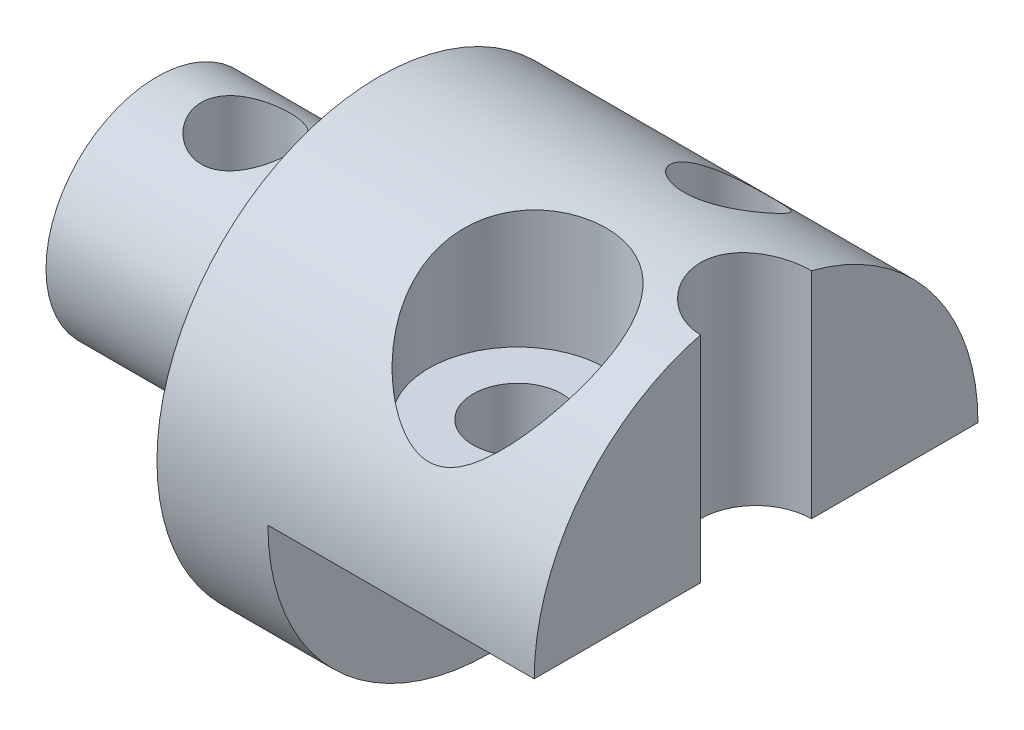
ISO-10303-21;
HEADER;
FILE_DESCRIPTION(('STEP AP214'),'2;1');
FILE_NAME('part.step','',(''),(''),'','','');
FILE_SCHEMA(('AUTOMOTIVE_DESIGN { 1 0 10303 214 1 1 1 1 }'));
ENDSEC;
DATA;
#1=APPLICATION_CONTEXT('core data for automotive mechanical design processes');
#2=APPLICATION_PROTOCOL_DEFINITION('international standard','automotive_design',2000,#1);
#3=PRODUCT_CONTEXT('',#1,'mechanical');
#4=PRODUCT('Part','Part','',(#3));
#5=PRODUCT_RELATED_PRODUCT_CATEGORY('part','',(#4));
#6=PRODUCT_DEFINITION_FORMATION('','',#4);
#7=PRODUCT_DEFINITION_CONTEXT('part definition',#1,'design');
#8=PRODUCT_DEFINITION('design','',#6,#7);
#9=PRODUCT_DEFINITION_SHAPE('','',#8);
#10=(LENGTH_UNIT() NAMED_UNIT(*) SI_UNIT(.MILLI.,.METRE.));
#11=(NAMED_UNIT(*) PLANE_ANGLE_UNIT() SI_UNIT($,.RADIAN.));
#12=(NAMED_UNIT(*) SI_UNIT($,.STERADIAN.) SOLID_ANGLE_UNIT());
#13=UNCERTAINTY_MEASURE_WITH_UNIT(LENGTH_MEASURE(1.E-05),#10,'distance_accuracy_value','');
#14=(GEOMETRIC_REPRESENTATION_CONTEXT(3) GLOBAL_UNCERTAINTY_ASSIGNED_CONTEXT((#13)) GLOBAL_UNIT_ASSIGNED_CONTEXT((#10,
#11,#12)) REPRESENTATION_CONTEXT('',''));
#15=CARTESIAN_POINT('',(0.,0.,0.));
#16=DIRECTION('',(0.,0.,1.));
#17=DIRECTION('',(1.,0.,0.));
#18=AXIS2_PLACEMENT_3D('',#15,#16,#17);
#19=CARTESIAN_POINT('',(-12.5,0.,0.874999999999988));
#20=DIRECTION('',(-1.,0.,0.));
#21=DIRECTION('',(0.,0.,1.));
#22=AXIS2_PLACEMENT_3D('',#19,#20,#21);
#23=CYLINDRICAL_SURFACE('',#22,10.);
#24=CARTESIAN_POINT('',(8.49999999999995,9.97183533758956,1.62499999999999));
#25=CARTESIAN_POINT('',(8.72342857085597,9.97183501271069,1.62499811854851));
#26=CARTESIAN_POINT('',(8.946846948339,9.97047722592947,1.64376344430953));
#27=CARTESIAN_POINT('',(9.38738048859625,9.96444970100898,1.71828136137339));
#28=CARTESIAN_POINT('',(9.60449597693852,9.95978013425366,1.77403203868208));
#29=CARTESIAN_POINT('',(10.0263494903959,9.9454236180423,1.92092645686251));
#30=CARTESIAN_POINT('',(10.2310819959248,9.93573444929036,2.01208584837815));
#31=CARTESIAN_POINT('',(10.6221208568015,9.90877159014059,2.22700638030204));
#32=CARTESIAN_POINT('',(10.8084283944862,9.89149838680048,2.35076542690888));
#33=CARTESIAN_POINT('',(11.1554759178273,9.84656559166447,2.62550693216701));
#34=CARTESIAN_POINT('',(11.3164400827609,9.81900530694927,2.77622214495401));
#35=CARTESIAN_POINT('',(11.6102597553043,9.75065968728539,3.100303276879));
#36=CARTESIAN_POINT('',(11.7431226982437,9.70987785788948,3.27366318474869));
#37=CARTESIAN_POINT('',(11.9748827021514,9.61402999766722,3.63255676451592));
#38=CARTESIAN_POINT('',(12.07445889747,9.55929578165851,3.81774138502876));
#39=CARTESIAN_POINT('',(12.2421037379824,9.43425514387872,4.19684346058784));
#40=CARTESIAN_POINT('',(12.3101726088619,9.36394883365528,4.39076085307064));
#41=CARTESIAN_POINT('',(12.4158618228328,9.20697776298318,4.78357036727107));
#42=CARTESIAN_POINT('',(12.4530358226371,9.12009477877165,4.98249402453808));
#43=CARTESIAN_POINT('',(12.4972301899204,8.93203024885893,5.37684869442238));
#44=CARTESIAN_POINT('',(12.5042373479112,8.83084245938066,5.57227813969841));
#45=CARTESIAN_POINT('',(12.4902634957933,8.60517520022657,5.97495589843248));
#46=CARTESIAN_POINT('',(12.4663270069729,8.47937032554607,6.18134982995202));
#47=CARTESIAN_POINT('',(12.3894929335148,8.21602505383958,6.58063333265788));
#48=CARTESIAN_POINT('',(12.3365895635665,8.07848231714327,6.77352019750923));
#49=CARTESIAN_POINT('',(12.1932519011426,7.76777080241629,7.17886539275976));
#50=CARTESIAN_POINT('',(12.0975970493884,7.59279788792603,7.38808064028162));
#51=CARTESIAN_POINT('',(11.8755071509979,7.23526200893511,7.78312050252622));
#52=CARTESIAN_POINT('',(11.7490014092136,7.05268242199759,7.96888988553797));
#53=CARTESIAN_POINT('',(11.5229705130496,6.75741298953425,8.24799938840879));
#54=CARTESIAN_POINT('',(11.4321755824009,6.64524775944447,8.34912325011631));
#55=CARTESIAN_POINT('',(11.2402477055323,6.42161044278618,8.54211899416098));
#56=CARTESIAN_POINT('',(11.1391097012663,6.3101387239032,8.63398630577538));
#57=CARTESIAN_POINT('',(10.9265678052276,6.09010660698456,8.80785603043938));
#58=CARTESIAN_POINT('',(10.8151944761701,5.98153871589737,8.88988622841203));
#59=CARTESIAN_POINT('',(10.5812252165511,5.76957639269819,9.04378745203308));
#60=CARTESIAN_POINT('',(10.458640816699,5.666176810547,9.115668726577));
#61=CARTESIAN_POINT('',(10.2171046772641,5.48079621343581,9.23990917601555));
#62=CARTESIAN_POINT('',(10.099657117781,5.39776073729095,9.29358773570201));
#63=CARTESIAN_POINT('',(9.85387154207294,5.24233315419241,9.39124033995246));
#64=CARTESIAN_POINT('',(9.72552583926481,5.16994865950102,9.43520745487968));
#65=CARTESIAN_POINT('',(9.45480811272252,5.04073075566054,9.51194430032071));
#66=CARTESIAN_POINT('',(9.31224116088062,4.98417078809039,9.54451931914301));
#67=CARTESIAN_POINT('',(9.09104043196444,4.91856504834529,9.5817992963765));
#68=CARTESIAN_POINT('',(9.01619061621851,4.89991476411214,9.59228897391451));
#69=CARTESIAN_POINT('',(8.86456284473983,4.86992200172336,9.60908030142984));
#70=CARTESIAN_POINT('',(8.78778561206175,4.85857682445405,9.61538349826823));
#71=CARTESIAN_POINT('',(8.64433927690126,4.84494695846125,9.62294484410437));
#72=CARTESIAN_POINT('',(8.5778013737546,4.84159537183624,9.62479735030693));
#73=CARTESIAN_POINT('',(8.44466064590822,4.84091998873766,9.62517111569836));
#74=CARTESIAN_POINT('',(8.37805780738028,4.84359808615998,9.62369132822916));
#75=CARTESIAN_POINT('',(8.24545825112978,4.85486312607168,9.61744500173219));
#76=CARTESIAN_POINT('',(8.17946209201385,4.86345505040742,9.61267569158204));
#77=CARTESIAN_POINT('',(8.04871261200747,4.88614898458137,9.60000512120433));
#78=CARTESIAN_POINT('',(7.98396010689085,4.90025448969461,9.59210187420523));
#79=CARTESIAN_POINT('',(7.77815065379163,4.95368239696007,9.56193437774407));
#80=CARTESIAN_POINT('',(7.64040752117642,5.00277166966406,9.53391456222897));
#81=CARTESIAN_POINT('',(7.37558707411236,5.11823505513678,9.46616435488908));
#82=CARTESIAN_POINT('',(7.24853478201866,5.18464830439866,9.42640742066351));
#83=CARTESIAN_POINT('',(7.0231959181665,5.3179682534963,9.34402729969812));
#84=CARTESIAN_POINT('',(6.9234583345832,5.38329541228115,9.3027367126068));
#85=CARTESIAN_POINT('',(6.73080836159161,5.51969230916278,9.21404171295015));
#86=CARTESIAN_POINT('',(6.6379007882069,5.59076602654813,9.16663305005544));
#87=CARTESIAN_POINT('',(6.4581929975842,5.73695465851548,9.06616841517867));
#88=CARTESIAN_POINT('',(6.37140634506614,5.81207793568154,9.01310051691517));
#89=CARTESIAN_POINT('',(6.20366925306908,5.96493631468545,8.90173586827614));
#90=CARTESIAN_POINT('',(6.12272040567648,6.04267212060193,8.84343770115612));
#91=CARTESIAN_POINT('',(5.92946735870104,6.23679933576449,8.69316282241968));
#92=CARTESIAN_POINT('',(5.82037073568064,6.35413854872926,8.59826504025163));
#93=CARTESIAN_POINT('',(5.61361759510665,6.59003115083393,8.39799584034547));
#94=CARTESIAN_POINT('',(5.51596623374082,6.70858506125127,8.29261974124957));
#95=CARTESIAN_POINT('',(5.33230979562116,6.94504393675664,8.07170252136127));
#96=CARTESIAN_POINT('',(5.24629639874133,7.06294930702092,7.95616876094153));
#97=CARTESIAN_POINT('',(5.08642644658501,7.29667855952241,7.71507714388065));
#98=CARTESIAN_POINT('',(5.01256563532943,7.41250315775733,7.58952281953403));
#99=CARTESIAN_POINT('',(4.89068621822493,7.61914694633293,7.35329957056249));
#100=CARTESIAN_POINT('',(4.84042174022715,7.71055548839374,7.24430101673067));
#101=CARTESIAN_POINT('',(4.74922854532511,7.89038477191735,7.02011718781128));
#102=CARTESIAN_POINT('',(4.70829801508372,7.97880609086972,6.9049331197854));
#103=CARTESIAN_POINT('',(4.6366474946248,8.1518254358646,6.66888718428644));
#104=CARTESIAN_POINT('',(4.60591460726628,8.23642817336887,6.5480327109014));
#105=CARTESIAN_POINT('',(4.55553690398831,8.4011715299867,6.30107879033402));
#106=CARTESIAN_POINT('',(4.53588994764107,8.48131300776751,6.17498036068568));
#107=CARTESIAN_POINT('',(4.51116870188279,8.62222374878166,5.9417826234002));
#108=CARTESIAN_POINT('',(4.50408898285142,8.68385884938095,5.8354168803986));
#109=CARTESIAN_POINT('',(4.49855679927081,8.80324419666161,5.62031477982722));
#110=CARTESIAN_POINT('',(4.50010264419607,8.86099520234193,5.51157889094364));
#111=CARTESIAN_POINT('',(4.51233820934129,8.97225286081257,5.29244030044039));
#112=CARTESIAN_POINT('',(4.52302857451222,9.02575921394227,5.18203748179389));
#113=CARTESIAN_POINT('',(4.55399673324053,9.12817439686337,4.96050054076786));
#114=CARTESIAN_POINT('',(4.57426979925126,9.17708547944598,4.84936680560961));
#115=CARTESIAN_POINT('',(4.62491069149022,9.27039489687766,4.62659387093557));
#116=CARTESIAN_POINT('',(4.65534411366487,9.31476139384609,4.51495616204399));
#117=CARTESIAN_POINT('',(4.72645713478691,9.39843507416822,4.29310858354423));
#118=CARTESIAN_POINT('',(4.76713214572155,9.43774451109416,4.18289809775367));
#119=CARTESIAN_POINT('',(4.85875762230873,9.51128687495609,3.96508670453486));
#120=CARTESIAN_POINT('',(4.90970756090721,9.54552006212288,3.85748566357173));
#121=CARTESIAN_POINT('',(5.0217178538114,9.60900129215322,3.64614898676459));
#122=CARTESIAN_POINT('',(5.08277722633409,9.63824981854553,3.54241297676331));
#123=CARTESIAN_POINT('',(5.20776408586266,9.68917935335126,3.35060162003836));
#124=CARTESIAN_POINT('',(5.27072789916973,9.71133150184899,3.26202147055636));
#125=CARTESIAN_POINT('',(5.40413141665907,9.75206118294804,3.08975483858619));
#126=CARTESIAN_POINT('',(5.47457353972505,9.77063755345313,3.00606995314558));
#127=CARTESIAN_POINT('',(5.62241143925763,9.80449356032507,2.84444732495835));
#128=CARTESIAN_POINT('',(5.69980378944127,9.81977480860235,2.76650678452691));
#129=CARTESIAN_POINT('',(5.86105555420716,9.84739662853473,2.61699946507133));
#130=CARTESIAN_POINT('',(5.94491738533316,9.85973609423793,2.54543508945425));
#131=CARTESIAN_POINT('',(6.11640968747802,9.88156732335895,2.41095570047725));
#132=CARTESIAN_POINT('',(6.20390237361564,9.89112004373833,2.34787497233365));
#133=CARTESIAN_POINT('',(6.3838471715409,9.90810699679614,2.22889148331315));
#134=CARTESIAN_POINT('',(6.4763010210983,9.91554048132814,2.17299126116224));
#135=CARTESIAN_POINT('',(6.76011632441153,9.93516190935448,2.01676883249657));
#136=CARTESIAN_POINT('',(6.95808339156849,9.94468869468556,1.92780583529474));
#137=CARTESIAN_POINT('',(7.37619129443563,9.95931693319145,1.77938072622294));
#138=CARTESIAN_POINT('',(7.59694727378991,9.96417002739421,1.72163945912408));
#139=CARTESIAN_POINT('',(8.04513865766358,9.97042953654962,1.6444484802976));
#140=CARTESIAN_POINT('',(8.27257460949416,9.97183566828006,1.62500191510797));
#141=CARTESIAN_POINT('',(8.49999999999995,9.97183533758956,1.62499999999999));
#142=B_SPLINE_CURVE_WITH_KNOTS('',3,(#24,#25,#26,#27,#28,#29,#30,#31,#32,#33,#34,#35,#36,#37,
#38,#39,#40,#41,#42,#43,#44,#45,#46,#47,#48,#49,#50,#51,#52,#53,#54,#55,#56,#57,#58,#59,#60,#61,
#62,#63,#64,#65,#66,#67,#68,#69,#70,#71,#72,#73,#74,#75,#76,#77,#78,#79,#80,#81,#82,#83,#84,#85,
#86,#87,#88,#89,#90,#91,#92,#93,#94,#95,#96,#97,#98,#99,#100,#101,#102,#103,#104,#105,#106,#107,
#108,#109,#110,#111,#112,#113,#114,#115,#116,#117,#118,#119,#120,#121,#122,#123,#124,#125,#126,
#127,#128,#129,#130,#131,#132,#133,#134,#135,#136,#137,#138,#139,#140,#141),.UNSPECIFIED.,.T.,
.F.,(4,2,2,2,2,2,2,2,2,2,2,2,2,2,2,2,2,2,2,2,2,2,2,2,2,2,2,2,2,2,2,2,2,2,2,2,2,2,2,2,2,2,2,2,2,
2,2,2,2,2,2,2,2,2,2,2,2,2,4),(0.,0.669481925754829,1.33892920848245,2.0086727240874,
2.67837323407991,3.3417692578817,4.00498953289464,4.65370875049889,5.30242332128074,
5.96035462290099,6.61857399088214,7.34455324127702,8.07067753829307,8.93474443994811,
9.80081027889743,10.3289760326201,10.8574013202905,11.3842970441381,11.9106568169465,
12.3703920034468,12.8304541834447,13.298034049071,13.5311785759131,13.7642369102836,
13.9638376995218,14.1635011911908,14.3633330868749,14.5632918698252,15.0072679243596,
15.452255782224,15.8302512461877,16.2085107379892,16.587583745744,16.9667597463882,
17.5246810159539,18.0828526754616,18.6406231585115,19.1981978860417,19.6504117848484,
20.1025377555686,20.5540897154488,21.0055544616008,21.3746095459015,21.7435923015848,
22.1126010832816,22.4814280072332,22.8526836953456,23.2237733638347,23.5948440020592,
23.9658786246777,24.2982073087064,24.6306438149427,24.9629173288452,25.295315563412,
25.6197775314273,25.9443539016829,26.5929324138826,27.2743344339642,27.9557924400644),.UNSPECIFIED.);
#143=CARTESIAN_POINT('',(8.49999999999995,9.97183533758956,1.62499999999999));
#144=VERTEX_POINT('',#143);
#145=EDGE_CURVE('E130',#144,#144,#142,.T.);
#146=ORIENTED_EDGE('',*,*,#145,.T.);
#147=EDGE_LOOP('',(#146));
#148=FACE_BOUND('',#147,.T.);
#149=CARTESIAN_POINT('',(8.49999999999995,7.37817728168685,-5.87500000000001));
#150=CARTESIAN_POINT('',(8.59334711347232,7.37818479889109,-5.87499359954797));
#151=CARTESIAN_POINT('',(8.68674505304167,7.38422249559099,-5.86841032329151));
#152=CARTESIAN_POINT('',(8.87031832485026,7.40769884900391,-5.84260980482035));
#153=CARTESIAN_POINT('',(8.96048995587453,7.42515018337181,-5.82337851373822));
#154=CARTESIAN_POINT('',(9.13443304140233,7.46953249408025,-5.7738469744942));
#155=CARTESIAN_POINT('',(9.21824672876505,7.49639273165832,-5.74362926273383));
#156=CARTESIAN_POINT('',(9.37885204575072,7.55756163465121,-5.67369612847223));
#157=CARTESIAN_POINT('',(9.45563915198854,7.59187505079381,-5.63397464652937));
#158=CARTESIAN_POINT('',(9.6309130293133,7.68094702490737,-5.52886451470398));
#159=CARTESIAN_POINT('',(9.7257063365243,7.73837798339086,-5.45957800868048));
#160=CARTESIAN_POINT('',(9.8996406809512,7.85979093192381,-5.30829427762822));
#161=CARTESIAN_POINT('',(9.97875888097075,7.92378227701049,-5.22627881320897));
#162=CARTESIAN_POINT('',(10.1222077745273,8.05618835399091,-5.05038080630121));
#163=CARTESIAN_POINT('',(10.1862748697972,8.12465839203379,-4.95632580635211));
#164=CARTESIAN_POINT('',(10.2974321023765,8.26249621737023,-4.75932567187048));
#165=CARTESIAN_POINT('',(10.3445229050573,8.33186396936823,-4.65638088596172));
#166=CARTESIAN_POINT('',(10.4268066002705,8.48011135553118,-4.42680223628587));
#167=CARTESIAN_POINT('',(10.459034584798,8.5588035721496,-4.29896653050721));
#168=CARTESIAN_POINT('',(10.4978356469519,8.71187554416483,-4.0368474105809));
#169=CARTESIAN_POINT('',(10.5044031074923,8.78625435184692,-3.90256259123446));
#170=CARTESIAN_POINT('',(10.4900387964526,8.92565450429025,-3.63658776816851));
#171=CARTESIAN_POINT('',(10.4700724202896,8.99091391779679,-3.50497422738374));
#172=CARTESIAN_POINT('',(10.4028634712451,9.11303938226047,-3.24484194807869));
#173=CARTESIAN_POINT('',(10.3556499160566,9.16991428178243,-3.11632006844774));
#174=CARTESIAN_POINT('',(10.2413243160705,9.26743368438482,-2.88380594252397));
#175=CARTESIAN_POINT('',(10.1773647148508,9.30921339514938,-2.77873886334536));
#176=CARTESIAN_POINT('',(10.0294670383615,9.38464077847075,-2.58039724394723));
#177=CARTESIAN_POINT('',(9.94554257084881,9.41829395860498,-2.48711473755292));
#178=CARTESIAN_POINT('',(9.76972898925663,9.47430911332991,-2.32563062334548));
#179=CARTESIAN_POINT('',(9.67955607795545,9.49747800071383,-2.25583404754343));
#180=CARTESIAN_POINT('',(9.48762971153725,9.53736988199722,-2.13212702307162));
#181=CARTESIAN_POINT('',(9.3858799136627,9.55409490428839,-2.07821157662055));
#182=CARTESIAN_POINT('',(9.17917240547654,9.58070680310138,-1.99066870902284));
#183=CARTESIAN_POINT('',(9.07461934865898,9.59088983708174,-1.9561730326706));
#184=CARTESIAN_POINT('',(8.86090853379153,9.60591594382556,-1.90476698035515));
#185=CARTESIAN_POINT('',(8.75175130242221,9.61075962565722,-1.88785459865071));
#186=CARTESIAN_POINT('',(8.53377977443934,9.61520343918445,-1.87234904975341));
#187=CARTESIAN_POINT('',(8.42498729389956,9.61488518427913,-1.87347075012523));
#188=CARTESIAN_POINT('',(8.20915340186829,9.60919566321602,-1.893296019239));
#189=CARTESIAN_POINT('',(8.10211192141155,9.60382459655917,-1.91199889382076));
#190=CARTESIAN_POINT('',(7.89305610674006,9.58790813659445,-1.9662685785209));
#191=CARTESIAN_POINT('',(7.79103108552089,9.57737431877095,-2.00179765636841));
#192=CARTESIAN_POINT('',(7.59459579314861,9.5509169488027,-2.08844833207192));
#193=CARTESIAN_POINT('',(7.50018535423158,9.53499351544173,-2.13956958628353));
#194=CARTESIAN_POINT('',(7.32087580815741,9.4974003433013,-2.25599661850626));
#195=CARTESIAN_POINT('',(7.2360477020054,9.47569126488542,-2.32139892901517));
#196=CARTESIAN_POINT('',(7.0787768030724,9.42644368973171,-2.4638358927533));
#197=CARTESIAN_POINT('',(7.00633464307292,9.3989048953222,-2.54087113991539));
#198=CARTESIAN_POINT('',(6.87368080964332,9.33726163707765,-2.70599013658904));
#199=CARTESIAN_POINT('',(6.81382659914276,9.30300814885724,-2.79430485019087));
#200=CARTESIAN_POINT('',(6.7096398064768,9.22869964295406,-2.97738421050539));
#201=CARTESIAN_POINT('',(6.66531051712081,9.18864339705994,-3.07215022044252));
#202=CARTESIAN_POINT('',(6.59021918829999,9.10068533426307,-3.27108727189794));
#203=CARTESIAN_POINT('',(6.56043430019652,9.05245641911785,-3.3754810868125));
#204=CARTESIAN_POINT('',(6.51819869473464,8.95094467812933,-3.5852909197271));
#205=CARTESIAN_POINT('',(6.50575522465105,8.89765974922152,-3.69070734657335));
#206=CARTESIAN_POINT('',(6.49699161030391,8.78146205555255,-3.91069860113403));
#207=CARTESIAN_POINT('',(6.50243717825594,8.71812108394772,-4.02511632420882));
#208=CARTESIAN_POINT('',(6.5321176364083,8.58813914807314,-4.24952116580627));
#209=CARTESIAN_POINT('',(6.55635912306281,8.52149703295039,-4.35950671459258));
#210=CARTESIAN_POINT('',(6.62629766376856,8.37870577661528,-4.58550881699588));
#211=CARTESIAN_POINT('',(6.67417092597125,8.30235571044004,-4.70072821424063));
#212=CARTESIAN_POINT('',(6.79069577208759,8.15021373718783,-4.92085736968193));
#213=CARTESIAN_POINT('',(6.8593804865614,8.07442291892511,-5.02575033345549));
#214=CARTESIAN_POINT('',(7.02111486651797,7.92276866920845,-5.22799508135221));
#215=CARTESIAN_POINT('',(7.11529139423491,7.84712784872799,-5.32462095348983));
#216=CARTESIAN_POINT('',(7.32549937630129,7.70570294263391,-5.49953725531881));
#217=CARTESIAN_POINT('',(7.44146388904301,7.63988974568557,-5.57788224074439));
#218=CARTESIAN_POINT('',(7.64556697433388,7.54741644562163,-5.68544899806846));
#219=CARTESIAN_POINT('',(7.72744161925618,7.51539836405648,-5.72200845641271));
#220=CARTESIAN_POINT('',(7.89793697357599,7.4601917576006,-5.78437493030146));
#221=CARTESIAN_POINT('',(7.98654321946856,7.43698491070593,-5.81020426861571));
#222=CARTESIAN_POINT('',(8.14606538585077,7.40582503731989,-5.84468419278532));
#223=CARTESIAN_POINT('',(8.21595363089006,7.3955213961605,-5.85600064806202));
#224=CARTESIAN_POINT('',(8.35721791403032,7.38169433546173,-5.87116133882957));
#225=CARTESIAN_POINT('',(8.42859408659164,7.37817153139834,-5.87500489602847));
#226=CARTESIAN_POINT('',(8.49999999999995,7.37817728168685,-5.87500000000001));
#227=B_SPLINE_CURVE_WITH_KNOTS('',3,(#149,#150,#151,#152,#153,#154,#155,#156,#157,#158,#159,
#160,#161,#162,#163,#164,#165,#166,#167,#168,#169,#170,#171,#172,#173,#174,#175,#176,#177,#178,
#179,#180,#181,#182,#183,#184,#185,#186,#187,#188,#189,#190,#191,#192,#193,#194,#195,#196,#197,
#198,#199,#200,#201,#202,#203,#204,#205,#206,#207,#208,#209,#210,#211,#212,#213,#214,#215,#216,
#217,#218,#219,#220,#221,#222,#223,#224,#225,#226),.UNSPECIFIED.,.T.,.F.,(4,2,2,2,2,2,2,2,2,2,2,
2,2,2,2,2,2,2,2,2,2,2,2,2,2,2,2,2,2,2,2,2,2,2,2,2,2,2,4),(0.,0.279726777452262,
0.559764789251477,0.837741052126874,1.1158950224432,1.5059198477337,1.89650879118156,
2.29349897836282,2.69047360415538,3.14882000126208,3.6072667247269,4.04948184504988,
4.49122688204646,4.87876860848624,5.26604694522895,5.61335148760505,5.9605466164042,
6.29064597241763,6.62070766958664,6.94555604638103,7.27039159767583,7.59450213916787,
7.9186055379289,8.24497154338959,8.57135421747691,8.90602848406102,9.24077369156086,
9.59566616549837,9.95070691063162,10.341803307574,10.7330370225092,11.1699892830977,
11.6076408325705,12.0692218004269,12.5294071305262,12.8140181947521,13.0980341571105,
13.3119918528895,13.5259689680432),.UNSPECIFIED.);
#228=CARTESIAN_POINT('',(8.49999999999995,7.37817728168685,-5.87500000000001));
#229=VERTEX_POINT('',#228);
#230=EDGE_CURVE('E113',#229,#229,#227,.T.);
#231=ORIENTED_EDGE('',*,*,#230,.T.);
#232=EDGE_LOOP('',(#231));
#233=FACE_BOUND('',#232,.T.);
#234=CARTESIAN_POINT('',(-2.50000000000004,0.,0.874999999999987));
#235=DIRECTION('',(-1.,0.,0.));
#236=DIRECTION('',(0.,0.,1.));
#237=AXIS2_PLACEMENT_3D('',#234,#235,#236);
#238=CIRCLE('',#237,10.);
#239=CARTESIAN_POINT('',(-2.50000000000004,0.,10.875));
#240=VERTEX_POINT('',#239);
#241=EDGE_CURVE('E122',#240,#240,#238,.T.);
#242=ORIENTED_EDGE('',*,*,#241,.F.);
#243=EDGE_LOOP('',(#242));
#244=FACE_BOUND('',#243,.T.);
#245=CARTESIAN_POINT('',(14.5,9.68374798309002,-1.62));
#246=CARTESIAN_POINT('',(14.4308566826214,9.68374026465547,-1.62000800450007));
#247=CARTESIAN_POINT('',(14.361718111193,9.68448686866654,-1.6171316416071));
#248=CARTESIAN_POINT('',(14.2239578966496,9.68743147865109,-1.60567235143657));
#249=CARTESIAN_POINT('',(14.1553361687102,9.68962924096877,-1.59709038215351));
#250=CARTESIAN_POINT('',(14.0192278010368,9.69541325448669,-1.57430448906958));
#251=CARTESIAN_POINT('',(13.9517391905994,9.69899676039056,-1.56011167967021));
#252=CARTESIAN_POINT('',(13.8182544274836,9.70743883846398,-1.52623584198222));
#253=CARTESIAN_POINT('',(13.7522582952203,9.7122974280636,-1.50655273864249));
#254=CARTESIAN_POINT('',(13.5572098269745,9.72858216669069,-1.43948375831779));
#255=CARTESIAN_POINT('',(13.4309609457962,9.7417235136434,-1.38405515426423));
#256=CARTESIAN_POINT('',(13.1895813718669,9.77108431159729,-1.25346473285166));
#257=CARTESIAN_POINT('',(13.0744536558538,9.78730458329073,-1.17829765211776));
#258=CARTESIAN_POINT('',(12.8560172367768,9.82138844665011,-1.00859957879412));
#259=CARTESIAN_POINT('',(12.7529847441563,9.83927803657547,-0.913717597743424));
#260=CARTESIAN_POINT('',(12.5641165839784,9.87445518909353,-0.708035996962634));
#261=CARTESIAN_POINT('',(12.4782836571847,9.89174265537532,-0.597233845163949));
#262=CARTESIAN_POINT('',(12.3251195820805,9.92405121632533,-0.360960256326839));
#263=CARTESIAN_POINT('',(12.2580607379766,9.93903765954125,-0.235307131943114));
#264=CARTESIAN_POINT('',(12.1461249157141,9.96475085639163,0.0259187758001722));
#265=CARTESIAN_POINT('',(12.1012435661263,9.97547844941049,0.1614895982188));
#266=CARTESIAN_POINT('',(12.0358258298061,9.99127512371191,0.435791914015531));
#267=CARTESIAN_POINT('',(12.0148145488215,9.99645446343749,0.574403691097049));
#268=CARTESIAN_POINT('',(11.99624124417,10.0009481347931,0.853277635347583));
#269=CARTESIAN_POINT('',(11.9986762869759,10.0002632001431,0.993539593858093));
#270=CARTESIAN_POINT('',(12.0265858473292,9.99318263966466,1.26844889079693));
#271=CARTESIAN_POINT('',(12.0515498275286,9.98691359820675,1.40315180253875));
#272=CARTESIAN_POINT('',(12.1229863717828,9.96950917900977,1.6663897617421));
#273=CARTESIAN_POINT('',(12.1694598997757,9.95837358318012,1.79492453249699));
#274=CARTESIAN_POINT('',(12.2830176702832,9.93228479730562,2.04354638584545));
#275=CARTESIAN_POINT('',(12.3502868432144,9.91729756591496,2.16354528333208));
#276=CARTESIAN_POINT('',(12.503384779872,9.88512788053523,2.39072760825889));
#277=CARTESIAN_POINT('',(12.5892163469932,9.86794509512209,2.49790909614216));
#278=CARTESIAN_POINT('',(12.7797437010259,9.8327045967296,2.69946816685893));
#279=CARTESIAN_POINT('',(12.8848862659934,9.81463578701362,2.79342188891608));
#280=CARTESIAN_POINT('',(13.1096564841093,9.78007664451636,2.96247935079292));
#281=CARTESIAN_POINT('',(13.2292880864367,9.76358674429063,3.03757793417733));
#282=CARTESIAN_POINT('',(13.4804818641022,9.7340069657394,3.16706456888835));
#283=CARTESIAN_POINT('',(13.6121040463298,9.72093561610387,3.22134047191194));
#284=CARTESIAN_POINT('',(13.8829336532074,9.69991525608089,3.30679214413827));
#285=CARTESIAN_POINT('',(14.0221293880353,9.69195858152585,3.33800248685786));
#286=CARTESIAN_POINT('',(14.2187753805247,9.68509459632008,3.36477591831604));
#287=CARTESIAN_POINT('',(14.2749049453194,9.68362364021087,3.37048593059182));
#288=CARTESIAN_POINT('',(14.3873474414814,9.68165977702128,3.37809368513668));
#289=CARTESIAN_POINT('',(14.443659928038,9.68116528816201,3.37999759297469));
#290=CARTESIAN_POINT('',(14.5,9.68116599382532,3.38));
#291=B_SPLINE_CURVE_WITH_KNOTS('',3,(#245,#246,#247,#248,#249,#250,#251,#252,#253,#254,#255,
#256,#257,#258,#259,#260,#261,#262,#263,#264,#265,#266,#267,#268,#269,#270,#271,#272,#273,#274,
#275,#276,#277,#278,#279,#280,#281,#282,#283,#284,#285,#286,#287,#288,#289,#290),.UNSPECIFIED.,
.F.,.F.,(4,2,2,2,2,2,2,2,2,2,2,2,2,2,2,2,2,2,2,2,2,2,4),(0.,0.207357932024925,0.414681056599717,
0.621595540347427,0.828512852709354,1.24193706083143,1.65547162296923,2.07711982535228,
2.49883516435379,2.92638297680381,3.35384648120803,3.7726479118479,4.19139694410853,
4.60088844498861,5.01039829877143,5.42366000188461,5.83698416169231,6.26146851923012,
6.68606883708163,7.11292492545436,7.53913988412414,7.70834527461238,7.87727634377457),.UNSPECIFIED.);
#292=CARTESIAN_POINT('',(14.5,9.68374798309002,-1.62));
#293=VERTEX_POINT('',#292);
#294=CARTESIAN_POINT('',(14.5,9.68116599382533,3.38));
#295=VERTEX_POINT('',#294);
#296=EDGE_CURVE('E87',#293,#295,#291,.T.);
#297=ORIENTED_EDGE('',*,*,#296,.F.);
#298=CARTESIAN_POINT('',(14.5,0.,0.87499999999999));
#299=DIRECTION('',(1.,0.,0.));
#300=DIRECTION('',(0.,0.,-1.));
#301=AXIS2_PLACEMENT_3D('',#298,#299,#300);
#302=CIRCLE('',#301,10.);
#303=CARTESIAN_POINT('',(14.5,0.,-9.12500000000001));
#304=VERTEX_POINT('',#303);
#305=EDGE_CURVE('E109',#304,#293,#302,.T.);
#306=ORIENTED_EDGE('',*,*,#305,.F.);
#307=DIRECTION('',(-1.,0.,0.));
#308=VECTOR('',#307,1.);
#309=CARTESIAN_POINT('',(14.5,0.,-9.12500000000001));
#310=LINE('',#309,#308);
#311=CARTESIAN_POINT('',(2.49999999999996,0.,-9.12500000000001));
#312=VERTEX_POINT('',#311);
#313=EDGE_CURVE('E104',#304,#312,#310,.T.);
#314=ORIENTED_EDGE('',*,*,#313,.T.);
#315=CARTESIAN_POINT('',(2.49999999999996,0.,0.874999999999987));
#316=DIRECTION('',(-1.,0.,0.));
#317=DIRECTION('',(0.,0.,1.));
#318=AXIS2_PLACEMENT_3D('',#315,#316,#317);
#319=CIRCLE('',#318,10.);
#320=CARTESIAN_POINT('',(2.49999999999996,0.,10.875));
#321=VERTEX_POINT('',#320);
#322=EDGE_CURVE('E125',#312,#321,#319,.T.);
#323=ORIENTED_EDGE('',*,*,#322,.T.);
#324=DIRECTION('',(-1.,0.,0.));
#325=VECTOR('',#324,1.);
#326=CARTESIAN_POINT('',(14.5,0.,10.875));
#327=LINE('',#326,#325);
#328=CARTESIAN_POINT('',(14.5,0.,10.875));
#329=VERTEX_POINT('',#328);
#330=EDGE_CURVE('E107',#329,#321,#327,.T.);
#331=ORIENTED_EDGE('',*,*,#330,.F.);
#332=EDGE_CURVE('E103',#295,#329,#302,.T.);
#333=ORIENTED_EDGE('',*,*,#332,.F.);
#334=EDGE_LOOP('',(#297,#306,#314,#323,#331,#333));
#335=FACE_BOUND('',#334,.T.);
#336=ADVANCED_FACE('F40',(#148,#233,#244,#335),#23,.T.);
#337=CARTESIAN_POINT('',(14.5,0.,0.87499999999999));
#338=DIRECTION('',(1.,0.,0.));
#339=DIRECTION('',(0.,0.,-1.));
#340=AXIS2_PLACEMENT_3D('',#337,#338,#339);
#341=PLANE('',#340);
#342=DIRECTION('',(0.,0.,-1.));
#343=VECTOR('',#342,1.);
#344=CARTESIAN_POINT('',(14.5,0.,10.875));
#345=LINE('',#344,#343);
#346=CARTESIAN_POINT('',(14.5,0.,3.38));
#347=VERTEX_POINT('',#346);
#348=EDGE_CURVE('E97',#329,#347,#345,.T.);
#349=ORIENTED_EDGE('',*,*,#348,.T.);
#350=DIRECTION('',(0.,-1.,0.));
#351=VECTOR('',#350,1.);
#352=CARTESIAN_POINT('',(14.5,10.,3.38));
#353=LINE('',#352,#351);
#354=EDGE_CURVE('E11',#347,#295,#353,.F.);
#355=ORIENTED_EDGE('',*,*,#354,.T.);
#356=ORIENTED_EDGE('',*,*,#332,.T.);
#357=EDGE_LOOP('',(#349,#355,#356));
#358=FACE_BOUND('',#357,.T.);
#359=ADVANCED_FACE('F102',(#358),#341,.T.);
#360=ORIENTED_EDGE('',*,*,#305,.T.);
#361=DIRECTION('',(0.,-1.,0.));
#362=VECTOR('',#361,1.);
#363=CARTESIAN_POINT('',(14.5,10.,-1.62));
#364=LINE('',#363,#362);
#365=CARTESIAN_POINT('',(14.5,0.,-1.62));
#366=VERTEX_POINT('',#365);
#367=EDGE_CURVE('E54',#293,#366,#364,.T.);
#368=ORIENTED_EDGE('',*,*,#367,.T.);
#369=EDGE_CURVE('E100',#366,#304,#345,.T.);
#370=ORIENTED_EDGE('',*,*,#369,.T.);
#371=EDGE_LOOP('',(#360,#368,#370));
#372=FACE_BOUND('',#371,.T.);
#373=ADVANCED_FACE('F198',(#372),#341,.T.);
#374=CARTESIAN_POINT('',(2.49999999999996,0.,0.874999999999987));
#375=DIRECTION('',(-1.,0.,0.));
#376=DIRECTION('',(0.,0.,1.));
#377=AXIS2_PLACEMENT_3D('',#374,#375,#376);
#378=PLANE('',#377);
#379=DIRECTION('',(0.,0.,-1.));
#380=VECTOR('',#379,1.);
#381=CARTESIAN_POINT('',(2.49999999999996,0.,10.875));
#382=LINE('',#381,#380);
#383=EDGE_CURVE('E69',#321,#312,#382,.T.);
#384=ORIENTED_EDGE('',*,*,#383,.F.);
#385=ORIENTED_EDGE('',*,*,#322,.F.);
#386=EDGE_LOOP('',(#384,#385));
#387=FACE_BOUND('',#386,.T.);
#388=ADVANCED_FACE('F42',(#387),#378,.F.);
#389=CARTESIAN_POINT('',(-2.50000000000004,0.,-9.12500000000001));
#390=DIRECTION('',(1.,0.,0.));
#391=DIRECTION('',(0.,0.,-1.));
#392=AXIS2_PLACEMENT_3D('',#389,#390,#391);
#393=PLANE('',#392);
#394=CARTESIAN_POINT('',(-2.50000000000004,0.,0.874999999999987));
#395=DIRECTION('',(-1.,0.,0.));
#396=DIRECTION('',(0.,0.,1.));
#397=AXIS2_PLACEMENT_3D('',#394,#395,#396);
#398=CIRCLE('',#397,5.);
#399=CARTESIAN_POINT('',(-2.50000000000004,0.,5.87499999999999));
#400=VERTEX_POINT('',#399);
#401=EDGE_CURVE('E119',#400,#400,#398,.T.);
#402=ORIENTED_EDGE('',*,*,#401,.F.);
#403=EDGE_LOOP('',(#402));
#404=FACE_BOUND('',#403,.T.);
#405=ORIENTED_EDGE('',*,*,#241,.T.);
#406=EDGE_LOOP('',(#405));
#407=FACE_BOUND('',#406,.T.);
#408=ADVANCED_FACE('F189',(#404,#407),#393,.F.);
#409=CARTESIAN_POINT('',(-12.5,0.,0.874999999999988));
#410=DIRECTION('',(-1.,0.,0.));
#411=DIRECTION('',(0.,0.,1.));
#412=AXIS2_PLACEMENT_3D('',#409,#410,#411);
#413=CYLINDRICAL_SURFACE('',#412,5.);
#414=CARTESIAN_POINT('',(-8.50000000000004,-4.58257569495584,2.87499999999999));
#415=CARTESIAN_POINT('',(-8.39287631028708,-4.58258022779737,2.87499540068021));
#416=CARTESIAN_POINT('',(-8.2855737056682,-4.58638433797122,2.86634173553405));
#417=CARTESIAN_POINT('',(-8.07406091590047,-4.601110833066,2.83206710874822));
#418=CARTESIAN_POINT('',(-7.96985934566152,-4.61205140628347,2.80640279032339));
#419=CARTESIAN_POINT('',(-7.76794819102922,-4.63960410719222,2.73923554476214));
#420=CARTESIAN_POINT('',(-7.67021575670882,-4.65619484260882,2.6977922899855));
#421=CARTESIAN_POINT('',(-7.48311464513774,-4.69314677188873,2.60042013194151));
#422=CARTESIAN_POINT('',(-7.39374414747594,-4.71350714220611,2.54449439157705));
#423=CARTESIAN_POINT('',(-7.22073968545571,-4.75700861562336,2.41632201423253));
#424=CARTESIAN_POINT('',(-7.1376436006028,-4.78023917022606,2.3433793683655));
#425=CARTESIAN_POINT('',(-6.98447097914424,-4.82612457915277,2.18470909513214));
#426=CARTESIAN_POINT('',(-6.91439899229034,-4.84877922991761,2.09897701877346));
#427=CARTESIAN_POINT('',(-6.78659360969033,-4.89203407641395,1.91300631337302));
#428=CARTESIAN_POINT('',(-6.72945570031411,-4.9125180361257,1.81232896641908));
#429=CARTESIAN_POINT('',(-6.63315642982625,-4.94803927702516,1.60182532206863));
#430=CARTESIAN_POINT('',(-6.59398775375118,-4.96307877403249,1.49200276907687));
#431=CARTESIAN_POINT('',(-6.53665851400695,-4.98538324990609,1.27196642703974));
#432=CARTESIAN_POINT('',(-6.51757268602982,-4.99298936770628,1.1620289848583));
#433=CARTESIAN_POINT('',(-6.49797151421859,-5.00080310687431,0.940266328583949));
#434=CARTESIAN_POINT('',(-6.49744924403424,-5.00101348770556,0.828441834160575));
#435=CARTESIAN_POINT('',(-6.51448276980424,-4.99421962820612,0.612767505297898));
#436=CARTESIAN_POINT('',(-6.53102477275476,-4.98761996771485,0.50882254712953));
#437=CARTESIAN_POINT('',(-6.57999287630301,-4.96849291469141,0.305326890778073));
#438=CARTESIAN_POINT('',(-6.61242014239851,-4.95596508721342,0.205776515608748));
#439=CARTESIAN_POINT('',(-6.6926364828783,-4.92596824457467,0.0121020614894291));
#440=CARTESIAN_POINT('',(-6.74064971481543,-4.90842760466223,-0.081917623378908));
#441=CARTESIAN_POINT('',(-6.8504650069192,-4.87014585180275,-0.260808150741324));
#442=CARTESIAN_POINT('',(-6.91227179310021,-4.84940364267149,-0.345675842717974));
#443=CARTESIAN_POINT('',(-7.05264913594392,-4.80521637176122,-0.509768827990189));
#444=CARTESIAN_POINT('',(-7.13205389257284,-4.78168326511759,-0.588257845266333));
#445=CARTESIAN_POINT('',(-7.30299057183204,-4.73561660973263,-0.731107415392663));
#446=CARTESIAN_POINT('',(-7.39452644819565,-4.71308339008076,-0.795463343786996));
#447=CARTESIAN_POINT('',(-7.59041902237398,-4.67096897409023,-0.909904188719284));
#448=CARTESIAN_POINT('',(-7.69506483033869,-4.65148914057708,-0.959534651636274));
#449=CARTESIAN_POINT('',(-7.91221549031226,-4.61887590344084,-1.04017625986647));
#450=CARTESIAN_POINT('',(-8.02471518472663,-4.60573837891311,-1.071199498378));
#451=CARTESIAN_POINT('',(-8.24703577746748,-4.58829759702716,-1.11195494885491));
#452=CARTESIAN_POINT('',(-8.3566004471286,-4.58350366456138,-1.12287209681456));
#453=CARTESIAN_POINT('',(-8.5760772077596,-4.58189497869038,-1.1265613264429));
#454=CARTESIAN_POINT('',(-8.6859891832757,-4.58507780560362,-1.1193389105913));
#455=CARTESIAN_POINT('',(-8.89645893495698,-4.59856044359113,-1.08803289479004));
#456=CARTESIAN_POINT('',(-8.9971929374001,-4.60844457798301,-1.06493306202388));
#457=CARTESIAN_POINT('',(-9.19328840478549,-4.6337005102734,-1.00380418691088));
#458=CARTESIAN_POINT('',(-9.28864867310719,-4.64907352488598,-0.96577183430229));
#459=CARTESIAN_POINT('',(-9.4756023577957,-4.68433781860101,-0.874135639481588));
#460=CARTESIAN_POINT('',(-9.56688618869457,-4.70438704639177,-0.819962868264661));
#461=CARTESIAN_POINT('',(-9.73948298744163,-4.74650385157795,-0.698165224441836));
#462=CARTESIAN_POINT('',(-9.82079187279549,-4.76857224896045,-0.630534873481907));
#463=CARTESIAN_POINT('',(-9.97737340859941,-4.81420915971416,-0.477844211680592));
#464=CARTESIAN_POINT('',(-10.0517565652916,-4.83776807285233,-0.39186542944545));
#465=CARTESIAN_POINT('',(-10.1851770766098,-4.88219794567532,-0.208083633368519));
#466=CARTESIAN_POINT('',(-10.2442138065952,-4.90306879593135,-0.110280138466622));
#467=CARTESIAN_POINT('',(-10.3450476264634,-4.9398371590039,0.0947200659969713));
#468=CARTESIAN_POINT('',(-10.3868488441737,-4.9557358624066,0.201914519001241));
#469=CARTESIAN_POINT('',(-10.4515488523998,-4.98072713468904,0.422606409085439));
#470=CARTESIAN_POINT('',(-10.4744579014107,-4.98982339706103,0.536100389723168));
#471=CARTESIAN_POINT('',(-10.4995047016529,-4.99979008211858,0.758183489637372));
#472=CARTESIAN_POINT('',(-10.5029001285621,-5.00115846749745,0.866609507347901));
#473=CARTESIAN_POINT('',(-10.4921445206166,-4.99686042373721,1.08243383579225));
#474=CARTESIAN_POINT('',(-10.4779961418445,-4.99119505948774,1.18983229961437));
#475=CARTESIAN_POINT('',(-10.4334532120002,-4.97371513381836,1.39717090173338));
#476=CARTESIAN_POINT('',(-10.4035710552435,-4.96209480698998,1.49723880386486));
#477=CARTESIAN_POINT('',(-10.328947194119,-4.93394947767358,1.69092235554259));
#478=CARTESIAN_POINT('',(-10.2842027490609,-4.91742357062859,1.78453681118911));
#479=CARTESIAN_POINT('',(-10.1788968066468,-4.88018094611867,1.96720303880514));
#480=CARTESIAN_POINT('',(-10.1177237246749,-4.859311306872,2.05587037518737));
#481=CARTESIAN_POINT('',(-9.98221146125305,-4.8158940222708,2.22205404014792));
#482=CARTESIAN_POINT('',(-9.90786683039183,-4.79334568464253,2.29956572919734));
#483=CARTESIAN_POINT('',(-9.74268485315139,-4.7473776736768,2.44620121894448));
#484=CARTESIAN_POINT('',(-9.65111142485594,-4.72399047228096,2.51450871002774));
#485=CARTESIAN_POINT('',(-9.45705756427921,-4.68049656850749,2.63484762763148));
#486=CARTESIAN_POINT('',(-9.3545758515465,-4.66039025195448,2.68687714055766));
#487=CARTESIAN_POINT('',(-9.15096381352985,-4.62758914239063,2.76899048451633));
#488=CARTESIAN_POINT('',(-9.0505383972876,-4.61439096680415,2.80062535665266));
#489=CARTESIAN_POINT('',(-8.8455109585074,-4.5944582603412,2.84771990928488));
#490=CARTESIAN_POINT('',(-8.74092142657569,-4.58770572290435,2.86322466191606));
#491=CARTESIAN_POINT('',(-8.61322176088852,-4.5839176394209,2.87192202185512));
#492=CARTESIAN_POINT('',(-8.59059851964361,-4.58341531117284,2.87307530751894));
#493=CARTESIAN_POINT('',(-8.54531952320282,-4.58274384722723,2.87461481124249));
#494=CARTESIAN_POINT('',(-8.52266376574489,-4.5825747359592,2.87500097306119));
#495=CARTESIAN_POINT('',(-8.50000000000004,-4.58257569495584,2.87499999999999));
#496=B_SPLINE_CURVE_WITH_KNOTS('',3,(#414,#415,#416,#417,#418,#419,#420,#421,#422,#423,#424,
#425,#426,#427,#428,#429,#430,#431,#432,#433,#434,#435,#436,#437,#438,#439,#440,#441,#442,#443,
#444,#445,#446,#447,#448,#449,#450,#451,#452,#453,#454,#455,#456,#457,#458,#459,#460,#461,#462,
#463,#464,#465,#466,#467,#468,#469,#470,#471,#472,#473,#474,#475,#476,#477,#478,#479,#480,#481,
#482,#483,#484,#485,#486,#487,#488,#489,#490,#491,#492,#493,#494,#495),.UNSPECIFIED.,.T.,.F.,(4,
2,2,2,2,2,2,2,2,2,2,2,2,2,2,2,2,2,2,2,2,2,2,2,2,2,2,2,2,2,2,2,2,2,2,2,2,2,2,2,4),(0.,
0.321277648767654,0.643377335822245,0.96427082329339,1.28509428823861,1.62255618284425,
1.96013574348342,2.31102669091428,2.6617746696948,2.99554182887184,3.32918445305672,
3.64408644830303,3.9590115512906,4.27868300234898,4.59846414940031,4.93924044081356,
5.28012807127127,5.63064458717257,5.98093304800101,6.3098214752442,6.63861014907939,
6.94867248085145,7.25880358651638,7.58151154652701,7.90435114525849,8.25103734246979,
8.59773764852748,8.94435487312812,9.29078375954136,9.61461039755953,9.93838801512602,
10.2522199444335,10.5661097782859,10.8938705113993,11.2217671656421,11.5699625328561,
11.9181988175919,12.2351666081908,12.5512463021924,12.619212852096,12.6871843847255),.UNSPECIFIED.);
#497=CARTESIAN_POINT('',(-8.50000000000004,-4.58257569495584,2.87499999999999));
#498=VERTEX_POINT('',#497);
#499=EDGE_CURVE('E44',#498,#498,#496,.T.);
#500=ORIENTED_EDGE('',*,*,#499,.T.);
#501=EDGE_LOOP('',(#500));
#502=FACE_BOUND('',#501,.T.);
#503=CARTESIAN_POINT('',(-8.50000000000004,4.58257569495584,2.87499999999999));
#504=CARTESIAN_POINT('',(-8.607123689713,4.58258022779737,2.87499540068021));
#505=CARTESIAN_POINT('',(-8.71442629433189,4.58638433797122,2.86634173553405));
#506=CARTESIAN_POINT('',(-8.92593908409962,4.601110833066,2.83206710874822));
#507=CARTESIAN_POINT('',(-9.03014065433856,4.61205140628347,2.80640279032339));
#508=CARTESIAN_POINT('',(-9.23205180897087,4.63960410719222,2.73923554476214));
#509=CARTESIAN_POINT('',(-9.32978424329126,4.65619484260882,2.6977922899855));
#510=CARTESIAN_POINT('',(-9.51688535486234,4.69314677188873,2.60042013194151));
#511=CARTESIAN_POINT('',(-9.60625585252415,4.71350714220611,2.54449439157705));
#512=CARTESIAN_POINT('',(-9.77926031454438,4.75700861562336,2.41632201423253));
#513=CARTESIAN_POINT('',(-9.86235639939729,4.78023917022606,2.3433793683655));
#514=CARTESIAN_POINT('',(-10.0155290208558,4.82612457915278,2.18470909513214));
#515=CARTESIAN_POINT('',(-10.0856010077097,4.84877922991761,2.09897701877346));
#516=CARTESIAN_POINT('',(-10.2134063903098,4.89203407641395,1.91300631337302));
#517=CARTESIAN_POINT('',(-10.270544299686,4.9125180361257,1.81232896641908));
#518=CARTESIAN_POINT('',(-10.3668435701738,4.94803927702516,1.60182532206863));
#519=CARTESIAN_POINT('',(-10.4060122462489,4.96307877403249,1.49200276907687));
#520=CARTESIAN_POINT('',(-10.4633414859931,4.98538324990609,1.27196642703974));
#521=CARTESIAN_POINT('',(-10.4824273139703,4.99298936770628,1.1620289848583));
#522=CARTESIAN_POINT('',(-10.5020284857815,5.00080310687431,0.94026632858395));
#523=CARTESIAN_POINT('',(-10.5025507559658,5.00101348770556,0.828441834160577));
#524=CARTESIAN_POINT('',(-10.4855172301958,4.99421962820612,0.612767505297899));
#525=CARTESIAN_POINT('',(-10.4689752272453,4.98761996771485,0.508822547129531));
#526=CARTESIAN_POINT('',(-10.4200071236971,4.96849291469141,0.305326890778074));
#527=CARTESIAN_POINT('',(-10.3875798576016,4.95596508721342,0.205776515608749));
#528=CARTESIAN_POINT('',(-10.3073635171218,4.92596824457467,0.0121020614894298));
#529=CARTESIAN_POINT('',(-10.2593502851847,4.90842760466223,-0.0819176233789079));
#530=CARTESIAN_POINT('',(-10.1495349930809,4.87014585180275,-0.260808150741324));
#531=CARTESIAN_POINT('',(-10.0877282068999,4.84940364267149,-0.345675842717974));
#532=CARTESIAN_POINT('',(-9.94735086405616,4.80521637176122,-0.509768827990189));
#533=CARTESIAN_POINT('',(-9.86794610742725,4.78168326511758,-0.588257845266333));
#534=CARTESIAN_POINT('',(-9.69700942816804,4.73561660973263,-0.731107415392663));
#535=CARTESIAN_POINT('',(-9.60547355180444,4.71308339008076,-0.795463343786995));
#536=CARTESIAN_POINT('',(-9.40958097762611,4.67096897409023,-0.909904188719283));
#537=CARTESIAN_POINT('',(-9.30493516966139,4.65148914057708,-0.959534651636274));
#538=CARTESIAN_POINT('',(-9.08778450968783,4.61887590344084,-1.04017625986647));
#539=CARTESIAN_POINT('',(-8.97528481527345,4.60573837891311,-1.071199498378));
#540=CARTESIAN_POINT('',(-8.75296422253261,4.58829759702716,-1.11195494885491));
#541=CARTESIAN_POINT('',(-8.64339955287148,4.58350366456138,-1.12287209681456));
#542=CARTESIAN_POINT('',(-8.42392279224048,4.58189497869038,-1.1265613264429));
#543=CARTESIAN_POINT('',(-8.31401081672439,4.58507780560362,-1.1193389105913));
#544=CARTESIAN_POINT('',(-8.1035410650431,4.59856044359113,-1.08803289479004));
#545=CARTESIAN_POINT('',(-8.00280706259998,4.60844457798301,-1.06493306202388));
#546=CARTESIAN_POINT('',(-7.80671159521459,4.6337005102734,-1.00380418691088));
#547=CARTESIAN_POINT('',(-7.71135132689289,4.64907352488598,-0.96577183430229));
#548=CARTESIAN_POINT('',(-7.52439764220439,4.68433781860101,-0.874135639481588));
#549=CARTESIAN_POINT('',(-7.43311381130551,4.70438704639177,-0.819962868264661));
#550=CARTESIAN_POINT('',(-7.26051701255846,4.74650385157795,-0.698165224441836));
#551=CARTESIAN_POINT('',(-7.1792081272046,4.76857224896045,-0.630534873481907));
#552=CARTESIAN_POINT('',(-7.02262659140067,4.81420915971416,-0.477844211680593));
#553=CARTESIAN_POINT('',(-6.94824343470845,4.83776807285233,-0.391865429445451));
#554=CARTESIAN_POINT('',(-6.81482292339027,4.88219794567532,-0.208083633368521));
#555=CARTESIAN_POINT('',(-6.75578619340492,4.90306879593135,-0.110280138466623));
#556=CARTESIAN_POINT('',(-6.6549523735367,4.9398371590039,0.0947200659969714));
#557=CARTESIAN_POINT('',(-6.61315115582638,4.9557358624066,0.201914519001242));
#558=CARTESIAN_POINT('',(-6.54845114760029,4.98072713468904,0.422606409085439));
#559=CARTESIAN_POINT('',(-6.52554209858935,4.98982339706103,0.536100389723167));
#560=CARTESIAN_POINT('',(-6.5004952983472,4.99979008211858,0.758183489637371));
#561=CARTESIAN_POINT('',(-6.49709987143802,5.00115846749745,0.866609507347899));
#562=CARTESIAN_POINT('',(-6.50785547938351,4.99686042373721,1.08243383579225));
#563=CARTESIAN_POINT('',(-6.52200385815562,4.99119505948774,1.18983229961437));
#564=CARTESIAN_POINT('',(-6.56654678799993,4.97371513381836,1.39717090173338));
#565=CARTESIAN_POINT('',(-6.59642894475659,4.96209480698998,1.49723880386485));
#566=CARTESIAN_POINT('',(-6.67105280588111,4.93394947767358,1.69092235554259));
#567=CARTESIAN_POINT('',(-6.71579725093913,4.91742357062859,1.78453681118911));
#568=CARTESIAN_POINT('',(-6.82110319335327,4.88018094611867,1.96720303880514));
#569=CARTESIAN_POINT('',(-6.88227627532518,4.859311306872,2.05587037518737));
#570=CARTESIAN_POINT('',(-7.01778853874703,4.8158940222708,2.22205404014792));
#571=CARTESIAN_POINT('',(-7.09213316960826,4.79334568464253,2.29956572919733));
#572=CARTESIAN_POINT('',(-7.2573151468487,4.7473776736768,2.44620121894448));
#573=CARTESIAN_POINT('',(-7.34888857514414,4.72399047228096,2.51450871002774));
#574=CARTESIAN_POINT('',(-7.54294243572087,4.68049656850749,2.63484762763148));
#575=CARTESIAN_POINT('',(-7.64542414845358,4.66039025195448,2.68687714055766));
#576=CARTESIAN_POINT('',(-7.84903618647024,4.62758914239063,2.76899048451633));
#577=CARTESIAN_POINT('',(-7.94946160271248,4.61439096680415,2.80062535665266));
#578=CARTESIAN_POINT('',(-8.15448904149268,4.5944582603412,2.84771990928488));
#579=CARTESIAN_POINT('',(-8.2590785734244,4.58770572290435,2.86322466191606));
#580=CARTESIAN_POINT('',(-8.38677823911156,4.5839176394209,2.87192202185512));
#581=CARTESIAN_POINT('',(-8.40940148035647,4.58341531117284,2.87307530751894));
#582=CARTESIAN_POINT('',(-8.45468047679726,4.58274384722723,2.87461481124249));
#583=CARTESIAN_POINT('',(-8.4773362342552,4.5825747359592,2.87500097306119));
#584=CARTESIAN_POINT('',(-8.50000000000004,4.58257569495584,2.87499999999999));
#585=B_SPLINE_CURVE_WITH_KNOTS('',3,(#503,#504,#505,#506,#507,#508,#509,#510,#511,#512,#513,
#514,#515,#516,#517,#518,#519,#520,#521,#522,#523,#524,#525,#526,#527,#528,#529,#530,#531,#532,
#533,#534,#535,#536,#537,#538,#539,#540,#541,#542,#543,#544,#545,#546,#547,#548,#549,#550,#551,
#552,#553,#554,#555,#556,#557,#558,#559,#560,#561,#562,#563,#564,#565,#566,#567,#568,#569,#570,
#571,#572,#573,#574,#575,#576,#577,#578,#579,#580,#581,#582,#583,#584),.UNSPECIFIED.,.T.,.F.,(4,
2,2,2,2,2,2,2,2,2,2,2,2,2,2,2,2,2,2,2,2,2,2,2,2,2,2,2,2,2,2,2,2,2,2,2,2,2,2,2,4),(0.,
0.321277648767654,0.643377335822245,0.96427082329339,1.28509428823861,1.62255618284425,
1.96013574348342,2.31102669091428,2.6617746696948,2.99554182887183,3.32918445305672,
3.64408644830302,3.95901155129059,4.27868300234898,4.59846414940031,4.93924044081356,
5.28012807127127,5.63064458717257,5.98093304800101,6.30982147524421,6.6386101490794,
6.94867248085145,7.25880358651638,7.58151154652701,7.9043511452585,8.25103734246979,
8.59773764852748,8.94435487312813,9.29078375954136,9.61461039755953,9.93838801512602,
10.2522199444335,10.5661097782859,10.8938705113993,11.2217671656421,11.5699625328561,
11.9181988175919,12.2351666081908,12.5512463021924,12.619212852096,12.6871843847256),.UNSPECIFIED.);
#586=CARTESIAN_POINT('',(-8.50000000000004,4.58257569495584,2.87499999999999));
#587=VERTEX_POINT('',#586);
#588=EDGE_CURVE('E179',#587,#587,#585,.T.);
#589=ORIENTED_EDGE('',*,*,#588,.T.);
#590=EDGE_LOOP('',(#589));
#591=FACE_BOUND('',#590,.T.);
#592=CARTESIAN_POINT('',(-12.5,0.,0.874999999999988));
#593=DIRECTION('',(-1.,0.,0.));
#594=DIRECTION('',(0.,0.,1.));
#595=AXIS2_PLACEMENT_3D('',#592,#593,#594);
#596=CIRCLE('',#595,5.);
#597=CARTESIAN_POINT('',(-12.5,0.,5.87499999999999));
#598=VERTEX_POINT('',#597);
#599=EDGE_CURVE('E116',#598,#598,#596,.T.);
#600=ORIENTED_EDGE('',*,*,#599,.F.);
#601=EDGE_LOOP('',(#600));
#602=FACE_BOUND('',#601,.T.);
#603=ORIENTED_EDGE('',*,*,#401,.T.);
#604=EDGE_LOOP('',(#603));
#605=FACE_BOUND('',#604,.T.);
#606=ADVANCED_FACE('F184',(#502,#591,#602,#605),#413,.T.);
#607=CARTESIAN_POINT('',(-12.5,0.,-4.12500000000001));
#608=DIRECTION('',(1.,0.,0.));
#609=DIRECTION('',(0.,0.,-1.));
#610=AXIS2_PLACEMENT_3D('',#607,#608,#609);
#611=PLANE('',#610);
#612=ORIENTED_EDGE('',*,*,#599,.T.);
#613=EDGE_LOOP('',(#612));
#614=FACE_BOUND('',#613,.T.);
#615=ADVANCED_FACE('F188',(#614),#611,.F.);
#616=CARTESIAN_POINT('',(14.5,0.,10.875));
#617=DIRECTION('',(0.,1.,0.));
#618=DIRECTION('',(0.,0.,1.));
#619=AXIS2_PLACEMENT_3D('',#616,#617,#618);
#620=PLANE('',#619);
#621=CARTESIAN_POINT('',(14.5,0.,0.88));
#622=DIRECTION('',(0.,1.,0.));
#623=DIRECTION('',(0.,0.,1.));
#624=AXIS2_PLACEMENT_3D('',#621,#622,#623);
#625=CIRCLE('',#624,2.5);
#626=EDGE_CURVE('E62',#366,#347,#625,.T.);
#627=ORIENTED_EDGE('',*,*,#626,.T.);
#628=ORIENTED_EDGE('',*,*,#348,.F.);
#629=ORIENTED_EDGE('',*,*,#330,.T.);
#630=ORIENTED_EDGE('',*,*,#383,.T.);
#631=ORIENTED_EDGE('',*,*,#313,.F.);
#632=ORIENTED_EDGE('',*,*,#369,.F.);
#633=EDGE_LOOP('',(#627,#628,#629,#630,#631,#632));
#634=FACE_BOUND('',#633,.T.);
#635=CARTESIAN_POINT('',(8.49999999999995,0.,-3.87500000000001));
#636=DIRECTION('',(0.,-1.,0.));
#637=DIRECTION('',(0.,0.,-1.));
#638=AXIS2_PLACEMENT_3D('',#635,#636,#637);
#639=CIRCLE('',#638,2.);
#640=CARTESIAN_POINT('',(8.49999999999995,0.,-5.87500000000001));
#641=VERTEX_POINT('',#640);
#642=EDGE_CURVE('E161',#641,#641,#639,.T.);
#643=ORIENTED_EDGE('',*,*,#642,.F.);
#644=EDGE_LOOP('',(#643));
#645=FACE_BOUND('',#644,.T.);
#646=CARTESIAN_POINT('',(8.49999999999995,0.,5.62499999999999));
#647=DIRECTION('',(0.,-1.,0.));
#648=DIRECTION('',(0.,0.,-1.));
#649=AXIS2_PLACEMENT_3D('',#646,#647,#648);
#650=CIRCLE('',#649,2.);
#651=CARTESIAN_POINT('',(8.49999999999995,0.,3.62499999999999));
#652=VERTEX_POINT('',#651);
#653=EDGE_CURVE('E138',#652,#652,#650,.T.);
#654=ORIENTED_EDGE('',*,*,#653,.F.);
#655=EDGE_LOOP('',(#654));
#656=FACE_BOUND('',#655,.T.);
#657=ADVANCED_FACE('F94',(#634,#645,#656),#620,.F.);
#658=CARTESIAN_POINT('',(8.49999999999995,12.,5.62499999999999));
#659=DIRECTION('',(0.,-1.,0.));
#660=DIRECTION('',(0.,0.,-1.));
#661=AXIS2_PLACEMENT_3D('',#658,#659,#660);
#662=CYLINDRICAL_SURFACE('',#661,2.);
#663=CARTESIAN_POINT('',(8.49999999999995,4.5,5.62499999999999));
#664=DIRECTION('',(0.,-1.,0.));
#665=DIRECTION('',(0.,0.,-1.));
#666=AXIS2_PLACEMENT_3D('',#663,#664,#665);
#667=CIRCLE('',#666,2.);
#668=CARTESIAN_POINT('',(8.49999999999995,4.5,3.62499999999999));
#669=VERTEX_POINT('',#668);
#670=EDGE_CURVE('E127',#669,#669,#667,.F.);
#671=ORIENTED_EDGE('',*,*,#670,.T.);
#672=EDGE_LOOP('',(#671));
#673=FACE_BOUND('',#672,.T.);
#674=ORIENTED_EDGE('',*,*,#653,.T.);
#675=EDGE_LOOP('',(#674));
#676=FACE_BOUND('',#675,.T.);
#677=ADVANCED_FACE('F153',(#673,#676),#662,.F.);
#678=CARTESIAN_POINT('',(8.49999999999995,12.,-3.87500000000001));
#679=DIRECTION('',(0.,-1.,0.));
#680=DIRECTION('',(0.,0.,-1.));
#681=AXIS2_PLACEMENT_3D('',#678,#679,#680);
#682=CYLINDRICAL_SURFACE('',#681,2.);
#683=ORIENTED_EDGE('',*,*,#642,.T.);
#684=EDGE_LOOP('',(#683));
#685=FACE_BOUND('',#684,.T.);
#686=ORIENTED_EDGE('',*,*,#230,.F.);
#687=EDGE_LOOP('',(#686));
#688=FACE_BOUND('',#687,.T.);
#689=ADVANCED_FACE('F147',(#685,#688),#682,.F.);
#690=CARTESIAN_POINT('',(8.49999999999995,14.5,5.62499999999999));
#691=DIRECTION('',(0.,-1.,0.));
#692=DIRECTION('',(0.,0.,-1.));
#693=AXIS2_PLACEMENT_3D('',#690,#691,#692);
#694=CYLINDRICAL_SURFACE('',#693,4.);
#695=CARTESIAN_POINT('',(8.49999999999995,4.5,5.62499999999999));
#696=DIRECTION('',(0.,-1.,0.));
#697=DIRECTION('',(0.,0.,-1.));
#698=AXIS2_PLACEMENT_3D('',#695,#696,#697);
#699=CIRCLE('',#698,4.);
#700=CARTESIAN_POINT('',(8.49999999999995,4.5,1.62499999999999));
#701=VERTEX_POINT('',#700);
#702=EDGE_CURVE('E131',#701,#701,#699,.T.);
#703=ORIENTED_EDGE('',*,*,#702,.T.);
#704=EDGE_LOOP('',(#703));
#705=FACE_BOUND('',#704,.T.);
#706=ORIENTED_EDGE('',*,*,#145,.F.);
#707=EDGE_LOOP('',(#706));
#708=FACE_BOUND('',#707,.T.);
#709=ADVANCED_FACE('F141',(#705,#708),#694,.F.);
#710=CARTESIAN_POINT('',(8.49999999999995,4.5,5.62499999999999));
#711=DIRECTION('',(0.,-1.,0.));
#712=DIRECTION('',(0.,0.,-1.));
#713=AXIS2_PLACEMENT_3D('',#710,#711,#712);
#714=PLANE('',#713);
#715=ORIENTED_EDGE('',*,*,#702,.F.);
#716=EDGE_LOOP('',(#715));
#717=FACE_BOUND('',#716,.T.);
#718=ORIENTED_EDGE('',*,*,#670,.F.);
#719=EDGE_LOOP('',(#718));
#720=FACE_BOUND('',#719,.T.);
#721=ADVANCED_FACE('F146',(#717,#720),#714,.F.);
#722=CARTESIAN_POINT('',(14.5,10.,0.88));
#723=DIRECTION('',(0.,-1.,0.));
#724=DIRECTION('',(0.,0.,-1.));
#725=AXIS2_PLACEMENT_3D('',#722,#723,#724);
#726=CYLINDRICAL_SURFACE('',#725,2.5);
#727=ORIENTED_EDGE('',*,*,#626,.F.);
#728=ORIENTED_EDGE('',*,*,#367,.F.);
#729=ORIENTED_EDGE('',*,*,#296,.T.);
#730=ORIENTED_EDGE('',*,*,#354,.F.);
#731=EDGE_LOOP('',(#727,#728,#729,#730));
#732=FACE_BOUND('',#731,.T.);
#733=ADVANCED_FACE('F85',(#732),#726,.F.);
#734=CARTESIAN_POINT('',(-8.50000000000004,-10.,0.874999999999987));
#735=DIRECTION('',(0.,1.,0.));
#736=DIRECTION('',(0.,0.,1.));
#737=AXIS2_PLACEMENT_3D('',#734,#735,#736);
#738=CYLINDRICAL_SURFACE('',#737,2.);
#739=ORIENTED_EDGE('',*,*,#588,.F.);
#740=EDGE_LOOP('',(#739));
#741=FACE_BOUND('',#740,.T.);
#742=ORIENTED_EDGE('',*,*,#499,.F.);
#743=EDGE_LOOP('',(#742));
#744=FACE_BOUND('',#743,.T.);
#745=ADVANCED_FACE('F174',(#741,#744),#738,.F.);
#746=CLOSED_SHELL('',(#336,#359,#373,#388,#408,#606,#615,#657,#677,#689,#709,#721,#733,#745));
#747=MANIFOLD_SOLID_BREP('B2',#746);
#748=ADVANCED_BREP_SHAPE_REPRESENTATION('',(#18,#747),#14);
#749=SHAPE_DEFINITION_REPRESENTATION(#9,#748);
ENDSEC;
END-ISO-10303-21;
